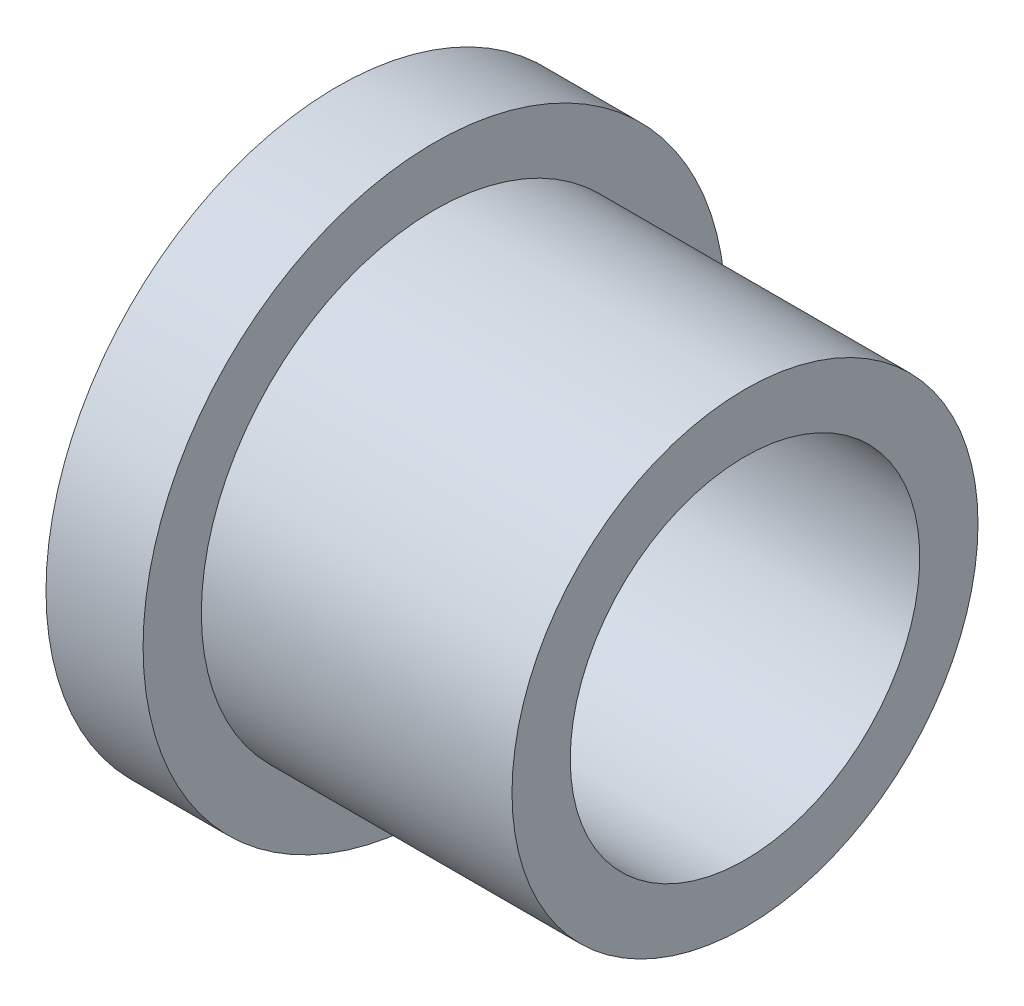
ISO-10303-21;
HEADER;
FILE_DESCRIPTION(('STEP AP214'),'2;1');
FILE_NAME('part.step','',(''),(''),'','','');
FILE_SCHEMA(('AUTOMOTIVE_DESIGN { 1 0 10303 214 1 1 1 1 }'));
ENDSEC;
DATA;
#1=APPLICATION_CONTEXT('core data for automotive mechanical design processes');
#2=APPLICATION_PROTOCOL_DEFINITION('international standard','automotive_design',2000,#1);
#3=PRODUCT_CONTEXT('',#1,'mechanical');
#4=PRODUCT('Part','Part','',(#3));
#5=PRODUCT_RELATED_PRODUCT_CATEGORY('part','',(#4));
#6=PRODUCT_DEFINITION_FORMATION('','',#4);
#7=PRODUCT_DEFINITION_CONTEXT('part definition',#1,'design');
#8=PRODUCT_DEFINITION('design','',#6,#7);
#9=PRODUCT_DEFINITION_SHAPE('','',#8);
#10=(LENGTH_UNIT() NAMED_UNIT(*) SI_UNIT(.MILLI.,.METRE.));
#11=(NAMED_UNIT(*) PLANE_ANGLE_UNIT() SI_UNIT($,.RADIAN.));
#12=(NAMED_UNIT(*) SI_UNIT($,.STERADIAN.) SOLID_ANGLE_UNIT());
#13=UNCERTAINTY_MEASURE_WITH_UNIT(LENGTH_MEASURE(1.E-05),#10,'distance_accuracy_value','');
#14=(GEOMETRIC_REPRESENTATION_CONTEXT(3) GLOBAL_UNCERTAINTY_ASSIGNED_CONTEXT((#13)) GLOBAL_UNIT_ASSIGNED_CONTEXT((#10,
#11,#12)) REPRESENTATION_CONTEXT('',''));
#15=CARTESIAN_POINT('',(0.,0.,0.));
#16=DIRECTION('',(0.,0.,1.));
#17=DIRECTION('',(1.,0.,0.));
#18=AXIS2_PLACEMENT_3D('',#15,#16,#17);
#19=CARTESIAN_POINT('',(0.,0.,0.));
#20=DIRECTION('',(-1.,0.,0.));
#21=DIRECTION('',(0.,0.,1.));
#22=AXIS2_PLACEMENT_3D('',#19,#20,#21);
#23=CYLINDRICAL_SURFACE('',#22,12.);
#24=CARTESIAN_POINT('',(5.,0.,0.));
#25=DIRECTION('',(-1.,0.,0.));
#26=DIRECTION('',(0.,0.,1.));
#27=AXIS2_PLACEMENT_3D('',#24,#25,#26);
#28=CIRCLE('',#27,12.);
#29=CARTESIAN_POINT('',(5.,0.,12.));
#30=VERTEX_POINT('',#29);
#31=EDGE_CURVE('E56',#30,#30,#28,.T.);
#32=ORIENTED_EDGE('',*,*,#31,.F.);
#33=EDGE_LOOP('',(#32));
#34=FACE_BOUND('',#33,.T.);
#35=CARTESIAN_POINT('',(21.,0.,0.));
#36=DIRECTION('',(-1.,0.,0.));
#37=DIRECTION('',(0.,0.,1.));
#38=AXIS2_PLACEMENT_3D('',#35,#36,#37);
#39=CIRCLE('',#38,12.);
#40=CARTESIAN_POINT('',(21.,0.,12.));
#41=VERTEX_POINT('',#40);
#42=EDGE_CURVE('E10',#41,#41,#39,.T.);
#43=ORIENTED_EDGE('',*,*,#42,.T.);
#44=EDGE_LOOP('',(#43));
#45=FACE_BOUND('',#44,.T.);
#46=ADVANCED_FACE('F34',(#34,#45),#23,.T.);
#47=CARTESIAN_POINT('',(21.,0.,-12.));
#48=DIRECTION('',(-1.,0.,0.));
#49=DIRECTION('',(0.,0.,1.));
#50=AXIS2_PLACEMENT_3D('',#47,#48,#49);
#51=PLANE('',#50);
#52=ORIENTED_EDGE('',*,*,#42,.F.);
#53=EDGE_LOOP('',(#52));
#54=FACE_BOUND('',#53,.T.);
#55=CARTESIAN_POINT('',(21.,0.,0.));
#56=DIRECTION('',(-1.,0.,0.));
#57=DIRECTION('',(0.,0.,1.));
#58=AXIS2_PLACEMENT_3D('',#55,#56,#57);
#59=CIRCLE('',#58,9.);
#60=CARTESIAN_POINT('',(21.,0.,9.));
#61=VERTEX_POINT('',#60);
#62=EDGE_CURVE('E40',#61,#61,#59,.T.);
#63=ORIENTED_EDGE('',*,*,#62,.T.);
#64=EDGE_LOOP('',(#63));
#65=FACE_BOUND('',#64,.T.);
#66=ADVANCED_FACE('F63',(#54,#65),#51,.F.);
#67=CARTESIAN_POINT('',(0.,0.,0.));
#68=DIRECTION('',(-1.,0.,0.));
#69=DIRECTION('',(0.,0.,1.));
#70=AXIS2_PLACEMENT_3D('',#67,#68,#69);
#71=CYLINDRICAL_SURFACE('',#70,9.);
#72=ORIENTED_EDGE('',*,*,#62,.F.);
#73=EDGE_LOOP('',(#72));
#74=FACE_BOUND('',#73,.T.);
#75=CARTESIAN_POINT('',(0.,0.,0.));
#76=DIRECTION('',(-1.,0.,0.));
#77=DIRECTION('',(0.,0.,1.));
#78=AXIS2_PLACEMENT_3D('',#75,#76,#77);
#79=CIRCLE('',#78,9.);
#80=CARTESIAN_POINT('',(0.,0.,9.));
#81=VERTEX_POINT('',#80);
#82=EDGE_CURVE('E44',#81,#81,#79,.T.);
#83=ORIENTED_EDGE('',*,*,#82,.T.);
#84=EDGE_LOOP('',(#83));
#85=FACE_BOUND('',#84,.T.);
#86=ADVANCED_FACE('F67',(#74,#85),#71,.F.);
#87=CARTESIAN_POINT('',(0.,0.,-15.));
#88=DIRECTION('',(1.,0.,0.));
#89=DIRECTION('',(0.,0.,-1.));
#90=AXIS2_PLACEMENT_3D('',#87,#88,#89);
#91=PLANE('',#90);
#92=ORIENTED_EDGE('',*,*,#82,.F.);
#93=EDGE_LOOP('',(#92));
#94=FACE_BOUND('',#93,.T.);
#95=CARTESIAN_POINT('',(0.,0.,0.));
#96=DIRECTION('',(-1.,0.,0.));
#97=DIRECTION('',(0.,0.,1.));
#98=AXIS2_PLACEMENT_3D('',#95,#96,#97);
#99=CIRCLE('',#98,15.);
#100=CARTESIAN_POINT('',(0.,0.,15.));
#101=VERTEX_POINT('',#100);
#102=EDGE_CURVE('E48',#101,#101,#99,.T.);
#103=ORIENTED_EDGE('',*,*,#102,.T.);
#104=EDGE_LOOP('',(#103));
#105=FACE_BOUND('',#104,.T.);
#106=ADVANCED_FACE('F72',(#94,#105),#91,.F.);
#107=CARTESIAN_POINT('',(0.,0.,0.));
#108=DIRECTION('',(-1.,0.,0.));
#109=DIRECTION('',(0.,0.,1.));
#110=AXIS2_PLACEMENT_3D('',#107,#108,#109);
#111=CYLINDRICAL_SURFACE('',#110,15.);
#112=ORIENTED_EDGE('',*,*,#102,.F.);
#113=EDGE_LOOP('',(#112));
#114=FACE_BOUND('',#113,.T.);
#115=CARTESIAN_POINT('',(5.,0.,0.));
#116=DIRECTION('',(-1.,0.,0.));
#117=DIRECTION('',(0.,0.,1.));
#118=AXIS2_PLACEMENT_3D('',#115,#116,#117);
#119=CIRCLE('',#118,15.);
#120=CARTESIAN_POINT('',(5.,0.,15.));
#121=VERTEX_POINT('',#120);
#122=EDGE_CURVE('E53',#121,#121,#119,.T.);
#123=ORIENTED_EDGE('',*,*,#122,.T.);
#124=EDGE_LOOP('',(#123));
#125=FACE_BOUND('',#124,.T.);
#126=ADVANCED_FACE('F78',(#114,#125),#111,.T.);
#127=CARTESIAN_POINT('',(5.,0.,-15.));
#128=DIRECTION('',(-1.,0.,0.));
#129=DIRECTION('',(0.,0.,1.));
#130=AXIS2_PLACEMENT_3D('',#127,#128,#129);
#131=PLANE('',#130);
#132=ORIENTED_EDGE('',*,*,#122,.F.);
#133=EDGE_LOOP('',(#132));
#134=FACE_BOUND('',#133,.T.);
#135=ORIENTED_EDGE('',*,*,#31,.T.);
#136=EDGE_LOOP('',(#135));
#137=FACE_BOUND('',#136,.T.);
#138=ADVANCED_FACE('F60',(#134,#137),#131,.F.);
#139=CLOSED_SHELL('',(#46,#66,#86,#106,#126,#138));
#140=MANIFOLD_SOLID_BREP('B2',#139);
#141=ADVANCED_BREP_SHAPE_REPRESENTATION('',(#18,#140),#14);
#142=SHAPE_DEFINITION_REPRESENTATION(#9,#141);
ENDSEC;
END-ISO-10303-21;
